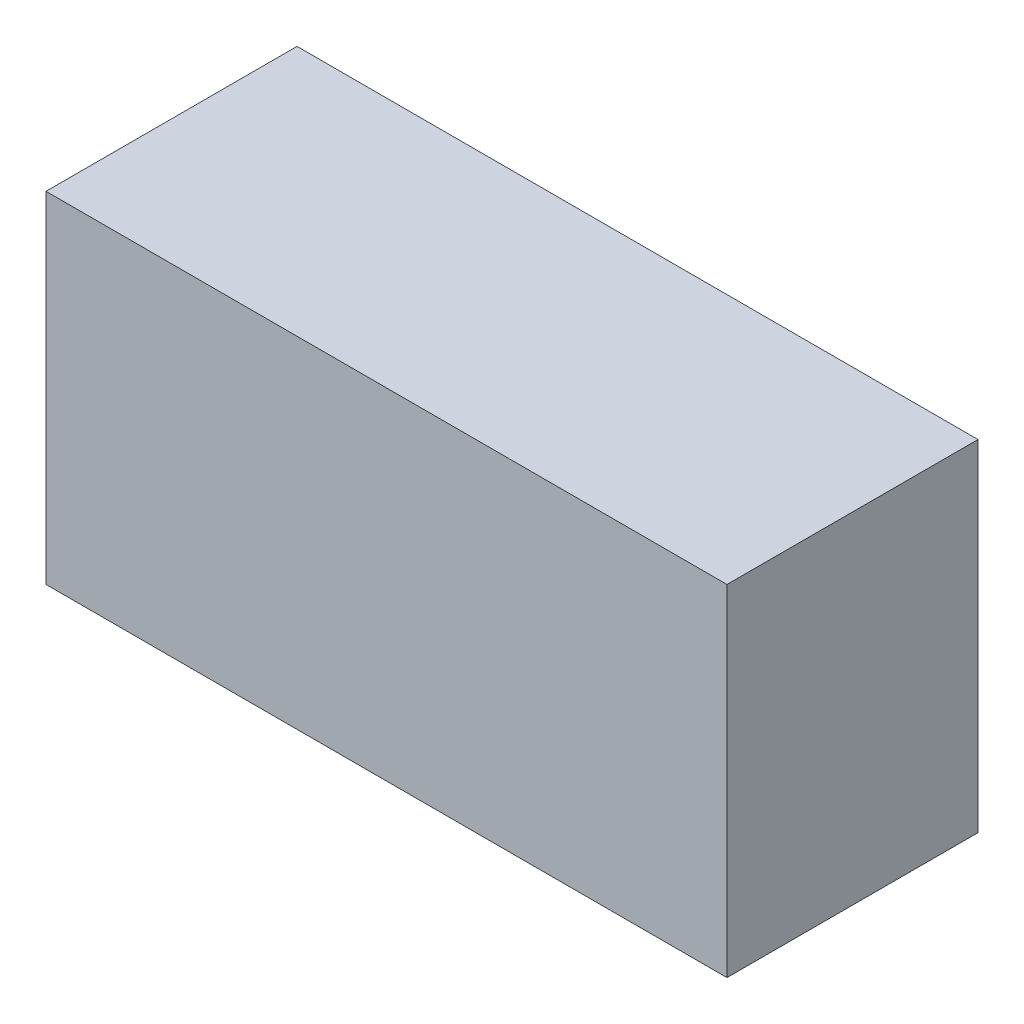
ISO-10303-21;
HEADER;
FILE_DESCRIPTION(('STEP AP214'),'2;1');
FILE_NAME('part.step','',(''),(''),'','','');
FILE_SCHEMA(('AUTOMOTIVE_DESIGN { 1 0 10303 214 1 1 1 1 }'));
ENDSEC;
DATA;
#1=APPLICATION_CONTEXT('core data for automotive mechanical design processes');
#2=APPLICATION_PROTOCOL_DEFINITION('international standard','automotive_design',2000,#1);
#3=PRODUCT_CONTEXT('',#1,'mechanical');
#4=PRODUCT('Part','Part','',(#3));
#5=PRODUCT_RELATED_PRODUCT_CATEGORY('part','',(#4));
#6=PRODUCT_DEFINITION_FORMATION('','',#4);
#7=PRODUCT_DEFINITION_CONTEXT('part definition',#1,'design');
#8=PRODUCT_DEFINITION('design','',#6,#7);
#9=PRODUCT_DEFINITION_SHAPE('','',#8);
#10=(LENGTH_UNIT() NAMED_UNIT(*) SI_UNIT(.MILLI.,.METRE.));
#11=(NAMED_UNIT(*) PLANE_ANGLE_UNIT() SI_UNIT($,.RADIAN.));
#12=(NAMED_UNIT(*) SI_UNIT($,.STERADIAN.) SOLID_ANGLE_UNIT());
#13=UNCERTAINTY_MEASURE_WITH_UNIT(LENGTH_MEASURE(1.E-05),#10,'distance_accuracy_value','');
#14=(GEOMETRIC_REPRESENTATION_CONTEXT(3) GLOBAL_UNCERTAINTY_ASSIGNED_CONTEXT((#13)) GLOBAL_UNIT_ASSIGNED_CONTEXT((#10,
#11,#12)) REPRESENTATION_CONTEXT('',''));
#15=CARTESIAN_POINT('',(0.,0.,0.));
#16=DIRECTION('',(0.,0.,1.));
#17=DIRECTION('',(1.,0.,0.));
#18=AXIS2_PLACEMENT_3D('',#15,#16,#17);
#19=CARTESIAN_POINT('',(29.972,14.986,22.098));
#20=DIRECTION('',(-1.,0.,0.));
#21=DIRECTION('',(0.,-1.,0.));
#22=AXIS2_PLACEMENT_3D('',#19,#20,#21);
#23=PLANE('',#22);
#24=DIRECTION('',(0.,1.,0.));
#25=VECTOR('',#24,1.);
#26=CARTESIAN_POINT('',(29.972,14.986,0.));
#27=LINE('',#26,#25);
#28=CARTESIAN_POINT('',(29.972,-14.986,0.));
#29=VERTEX_POINT('',#28);
#30=CARTESIAN_POINT('',(29.972,14.986,0.));
#31=VERTEX_POINT('',#30);
#32=EDGE_CURVE('E111',#29,#31,#27,.T.);
#33=ORIENTED_EDGE('',*,*,#32,.T.);
#34=DIRECTION('',(0.,0.,-1.));
#35=VECTOR('',#34,1.);
#36=CARTESIAN_POINT('',(29.972,14.986,22.098));
#37=LINE('',#36,#35);
#38=CARTESIAN_POINT('',(29.972,14.986,22.098));
#39=VERTEX_POINT('',#38);
#40=EDGE_CURVE('E11',#39,#31,#37,.T.);
#41=ORIENTED_EDGE('',*,*,#40,.F.);
#42=DIRECTION('',(0.,1.,0.));
#43=VECTOR('',#42,1.);
#44=CARTESIAN_POINT('',(29.972,14.986,22.098));
#45=LINE('',#44,#43);
#46=CARTESIAN_POINT('',(29.972,-14.986,22.098));
#47=VERTEX_POINT('',#46);
#48=EDGE_CURVE('E95',#47,#39,#45,.T.);
#49=ORIENTED_EDGE('',*,*,#48,.F.);
#50=DIRECTION('',(0.,0.,-1.));
#51=VECTOR('',#50,1.);
#52=CARTESIAN_POINT('',(29.972,-14.986,22.098));
#53=LINE('',#52,#51);
#54=EDGE_CURVE('E107',#47,#29,#53,.T.);
#55=ORIENTED_EDGE('',*,*,#54,.T.);
#56=EDGE_LOOP('',(#33,#41,#49,#55));
#57=FACE_BOUND('',#56,.T.);
#58=ADVANCED_FACE('F43',(#57),#23,.F.);
#59=CARTESIAN_POINT('',(-29.972,14.986,22.098));
#60=DIRECTION('',(0.,-1.,0.));
#61=DIRECTION('',(0.,0.,-1.));
#62=AXIS2_PLACEMENT_3D('',#59,#60,#61);
#63=PLANE('',#62);
#64=DIRECTION('',(-1.,0.,0.));
#65=VECTOR('',#64,1.);
#66=CARTESIAN_POINT('',(-29.972,14.986,0.));
#67=LINE('',#66,#65);
#68=CARTESIAN_POINT('',(-29.972,14.986,0.));
#69=VERTEX_POINT('',#68);
#70=EDGE_CURVE('E100',#31,#69,#67,.T.);
#71=ORIENTED_EDGE('',*,*,#70,.T.);
#72=DIRECTION('',(0.,0.,-1.));
#73=VECTOR('',#72,1.);
#74=CARTESIAN_POINT('',(-29.972,14.986,22.098));
#75=LINE('',#74,#73);
#76=CARTESIAN_POINT('',(-29.972,14.986,22.098));
#77=VERTEX_POINT('',#76);
#78=EDGE_CURVE('E52',#77,#69,#75,.T.);
#79=ORIENTED_EDGE('',*,*,#78,.F.);
#80=DIRECTION('',(-1.,0.,0.));
#81=VECTOR('',#80,1.);
#82=CARTESIAN_POINT('',(-29.972,14.986,22.098));
#83=LINE('',#82,#81);
#84=EDGE_CURVE('E90',#39,#77,#83,.T.);
#85=ORIENTED_EDGE('',*,*,#84,.F.);
#86=ORIENTED_EDGE('',*,*,#40,.T.);
#87=EDGE_LOOP('',(#71,#79,#85,#86));
#88=FACE_BOUND('',#87,.T.);
#89=ADVANCED_FACE('F99',(#88),#63,.F.);
#90=CARTESIAN_POINT('',(-29.972,14.986,22.098));
#91=DIRECTION('',(1.,0.,0.));
#92=DIRECTION('',(0.,1.,0.));
#93=AXIS2_PLACEMENT_3D('',#90,#91,#92);
#94=PLANE('',#93);
#95=DIRECTION('',(0.,-1.,0.));
#96=VECTOR('',#95,1.);
#97=CARTESIAN_POINT('',(-29.972,14.986,0.));
#98=LINE('',#97,#96);
#99=CARTESIAN_POINT('',(-29.972,-14.986,0.));
#100=VERTEX_POINT('',#99);
#101=EDGE_CURVE('E77',#69,#100,#98,.T.);
#102=ORIENTED_EDGE('',*,*,#101,.T.);
#103=DIRECTION('',(0.,0.,-1.));
#104=VECTOR('',#103,1.);
#105=CARTESIAN_POINT('',(-29.972,-14.986,22.098));
#106=LINE('',#105,#104);
#107=CARTESIAN_POINT('',(-29.972,-14.986,22.098));
#108=VERTEX_POINT('',#107);
#109=EDGE_CURVE('E102',#108,#100,#106,.T.);
#110=ORIENTED_EDGE('',*,*,#109,.F.);
#111=DIRECTION('',(0.,-1.,0.));
#112=VECTOR('',#111,1.);
#113=CARTESIAN_POINT('',(-29.972,14.986,22.098));
#114=LINE('',#113,#112);
#115=EDGE_CURVE('E93',#77,#108,#114,.T.);
#116=ORIENTED_EDGE('',*,*,#115,.F.);
#117=ORIENTED_EDGE('',*,*,#78,.T.);
#118=EDGE_LOOP('',(#102,#110,#116,#117));
#119=FACE_BOUND('',#118,.T.);
#120=ADVANCED_FACE('F103',(#119),#94,.F.);
#121=CARTESIAN_POINT('',(-29.972,-14.986,22.098));
#122=DIRECTION('',(0.,1.,0.));
#123=DIRECTION('',(0.,0.,1.));
#124=AXIS2_PLACEMENT_3D('',#121,#122,#123);
#125=PLANE('',#124);
#126=DIRECTION('',(1.,0.,0.));
#127=VECTOR('',#126,1.);
#128=CARTESIAN_POINT('',(-29.972,-14.986,0.));
#129=LINE('',#128,#127);
#130=EDGE_CURVE('E83',#100,#29,#129,.T.);
#131=ORIENTED_EDGE('',*,*,#130,.T.);
#132=ORIENTED_EDGE('',*,*,#54,.F.);
#133=DIRECTION('',(1.,0.,0.));
#134=VECTOR('',#133,1.);
#135=CARTESIAN_POINT('',(-29.972,-14.986,22.098));
#136=LINE('',#135,#134);
#137=EDGE_CURVE('E60',#108,#47,#136,.T.);
#138=ORIENTED_EDGE('',*,*,#137,.F.);
#139=ORIENTED_EDGE('',*,*,#109,.T.);
#140=EDGE_LOOP('',(#131,#132,#138,#139));
#141=FACE_BOUND('',#140,.T.);
#142=ADVANCED_FACE('F124',(#141),#125,.F.);
#143=CARTESIAN_POINT('',(0.,0.,22.098));
#144=DIRECTION('',(0.,0.,1.));
#145=DIRECTION('',(1.,0.,0.));
#146=AXIS2_PLACEMENT_3D('',#143,#144,#145);
#147=PLANE('',#146);
#148=ORIENTED_EDGE('',*,*,#48,.T.);
#149=ORIENTED_EDGE('',*,*,#84,.T.);
#150=ORIENTED_EDGE('',*,*,#115,.T.);
#151=ORIENTED_EDGE('',*,*,#137,.T.);
#152=EDGE_LOOP('',(#148,#149,#150,#151));
#153=FACE_BOUND('',#152,.T.);
#154=ADVANCED_FACE('F91',(#153),#147,.T.);
#155=CARTESIAN_POINT('',(0.,0.,0.));
#156=DIRECTION('',(0.,0.,1.));
#157=DIRECTION('',(1.,0.,0.));
#158=AXIS2_PLACEMENT_3D('',#155,#156,#157);
#159=PLANE('',#158);
#160=ORIENTED_EDGE('',*,*,#32,.F.);
#161=ORIENTED_EDGE('',*,*,#130,.F.);
#162=ORIENTED_EDGE('',*,*,#101,.F.);
#163=ORIENTED_EDGE('',*,*,#70,.F.);
#164=EDGE_LOOP('',(#160,#161,#162,#163));
#165=FACE_BOUND('',#164,.T.);
#166=ADVANCED_FACE('F127',(#165),#159,.F.);
#167=CLOSED_SHELL('',(#58,#89,#120,#142,#154,#166));
#168=MANIFOLD_SOLID_BREP('B2',#167);
#169=ADVANCED_BREP_SHAPE_REPRESENTATION('',(#18,#168),#14);
#170=SHAPE_DEFINITION_REPRESENTATION(#9,#169);
ENDSEC;
END-ISO-10303-21;
